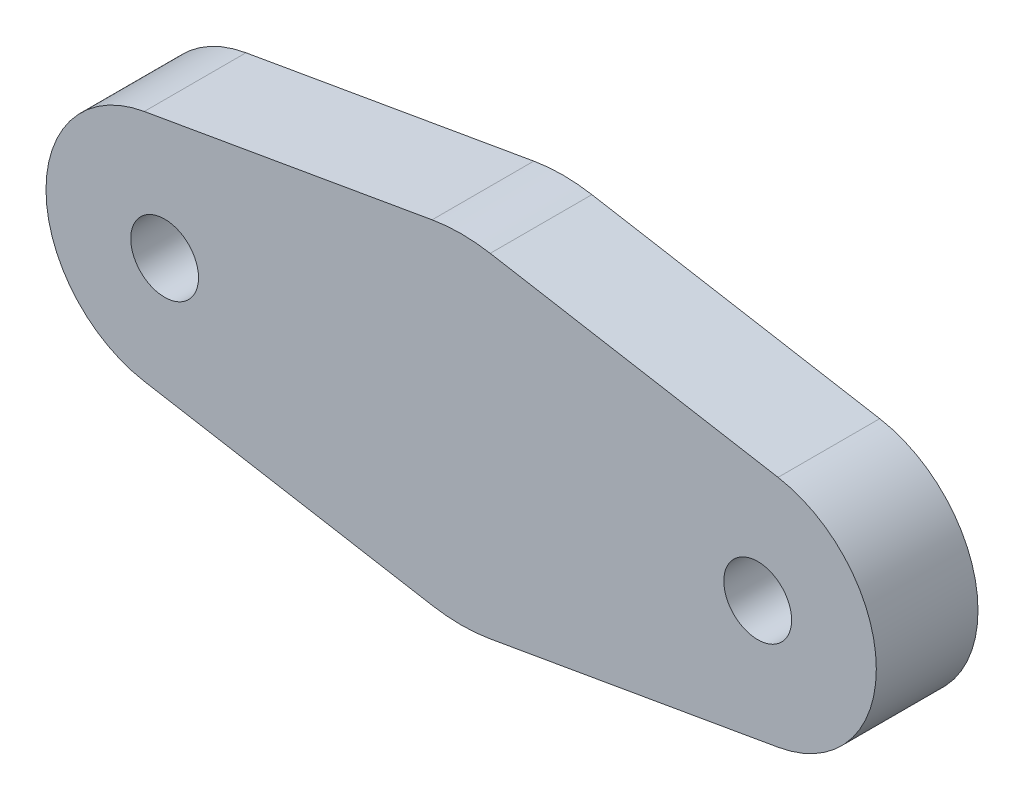
ISO-10303-21;
HEADER;
FILE_DESCRIPTION(('STEP AP214'),'2;1');
FILE_NAME('part.step','',(''),(''),'','','');
FILE_SCHEMA(('AUTOMOTIVE_DESIGN { 1 0 10303 214 1 1 1 1 }'));
ENDSEC;
DATA;
#1=APPLICATION_CONTEXT('core data for automotive mechanical design processes');
#2=APPLICATION_PROTOCOL_DEFINITION('international standard','automotive_design',2000,#1);
#3=PRODUCT_CONTEXT('',#1,'mechanical');
#4=PRODUCT('Part','Part','',(#3));
#5=PRODUCT_RELATED_PRODUCT_CATEGORY('part','',(#4));
#6=PRODUCT_DEFINITION_FORMATION('','',#4);
#7=PRODUCT_DEFINITION_CONTEXT('part definition',#1,'design');
#8=PRODUCT_DEFINITION('design','',#6,#7);
#9=PRODUCT_DEFINITION_SHAPE('','',#8);
#10=(LENGTH_UNIT() NAMED_UNIT(*) SI_UNIT(.MILLI.,.METRE.));
#11=(NAMED_UNIT(*) PLANE_ANGLE_UNIT() SI_UNIT($,.RADIAN.));
#12=(NAMED_UNIT(*) SI_UNIT($,.STERADIAN.) SOLID_ANGLE_UNIT());
#13=UNCERTAINTY_MEASURE_WITH_UNIT(LENGTH_MEASURE(1.E-05),#10,'distance_accuracy_value','');
#14=(GEOMETRIC_REPRESENTATION_CONTEXT(3) GLOBAL_UNCERTAINTY_ASSIGNED_CONTEXT((#13)) GLOBAL_UNIT_ASSIGNED_CONTEXT((#10,
#11,#12)) REPRESENTATION_CONTEXT('',''));
#15=CARTESIAN_POINT('',(0.,0.,0.));
#16=DIRECTION('',(0.,0.,1.));
#17=DIRECTION('',(1.,0.,0.));
#18=AXIS2_PLACEMENT_3D('',#15,#16,#17);
#19=CARTESIAN_POINT('',(0.,0.,6.));
#20=DIRECTION('',(0.,0.,1.));
#21=DIRECTION('',(1.,0.,0.));
#22=AXIS2_PLACEMENT_3D('',#19,#20,#21);
#23=PLANE('',#22);
#24=CARTESIAN_POINT('',(-17.5,0.,6.));
#25=DIRECTION('',(0.,0.,1.));
#26=DIRECTION('',(1.,0.,0.));
#27=AXIS2_PLACEMENT_3D('',#24,#25,#26);
#28=CIRCLE('',#27,2.);
#29=CARTESIAN_POINT('',(-15.5,0.,6.));
#30=VERTEX_POINT('',#29);
#31=EDGE_CURVE('E134',#30,#30,#28,.T.);
#32=ORIENTED_EDGE('',*,*,#31,.F.);
#33=EDGE_LOOP('',(#32));
#34=FACE_BOUND('',#33,.T.);
#35=CARTESIAN_POINT('',(0.,0.,6.));
#36=DIRECTION('',(0.,0.,1.));
#37=DIRECTION('',(1.,0.,0.));
#38=AXIS2_PLACEMENT_3D('',#35,#36,#37);
#39=CIRCLE('',#38,10.);
#40=CARTESIAN_POINT('',(1.71428571428571,9.8519655140381,6.));
#41=VERTEX_POINT('',#40);
#42=CARTESIAN_POINT('',(-1.71428571428571,9.8519655140381,6.));
#43=VERTEX_POINT('',#42);
#44=EDGE_CURVE('E145',#41,#43,#39,.T.);
#45=ORIENTED_EDGE('',*,*,#44,.T.);
#46=DIRECTION('',(-0.98519655140381,-0.171428571428572,0.));
#47=VECTOR('',#46,1.);
#48=CARTESIAN_POINT('',(-1.71428571428571,9.8519655140381,6.));
#49=LINE('',#48,#47);
#50=CARTESIAN_POINT('',(-18.7,6.89637585982667,6.));
#51=VERTEX_POINT('',#50);
#52=EDGE_CURVE('E93',#43,#51,#49,.T.);
#53=ORIENTED_EDGE('',*,*,#52,.T.);
#54=CARTESIAN_POINT('',(-17.5,0.,6.));
#55=DIRECTION('',(0.,0.,1.));
#56=DIRECTION('',(1.,0.,0.));
#57=AXIS2_PLACEMENT_3D('',#54,#55,#56);
#58=CIRCLE('',#57,7.);
#59=CARTESIAN_POINT('',(-18.7,-6.89637585982667,6.));
#60=VERTEX_POINT('',#59);
#61=EDGE_CURVE('E160',#51,#60,#58,.T.);
#62=ORIENTED_EDGE('',*,*,#61,.T.);
#63=DIRECTION('',(0.98519655140381,-0.171428571428572,0.));
#64=VECTOR('',#63,1.);
#65=CARTESIAN_POINT('',(-1.71428571428572,-9.8519655140381,6.));
#66=LINE('',#65,#64);
#67=CARTESIAN_POINT('',(-1.71428571428572,-9.8519655140381,6.));
#68=VERTEX_POINT('',#67);
#69=EDGE_CURVE('E173',#60,#68,#66,.T.);
#70=ORIENTED_EDGE('',*,*,#69,.T.);
#71=CARTESIAN_POINT('',(0.,0.,6.));
#72=DIRECTION('',(0.,0.,1.));
#73=DIRECTION('',(1.,0.,0.));
#74=AXIS2_PLACEMENT_3D('',#71,#72,#73);
#75=CIRCLE('',#74,10.);
#76=CARTESIAN_POINT('',(1.71428571428571,-9.8519655140381,6.));
#77=VERTEX_POINT('',#76);
#78=EDGE_CURVE('E112',#68,#77,#75,.T.);
#79=ORIENTED_EDGE('',*,*,#78,.T.);
#80=DIRECTION('',(0.985196551403809,0.171428571428572,0.));
#81=VECTOR('',#80,1.);
#82=CARTESIAN_POINT('',(18.7,-6.89637585982667,6.));
#83=LINE('',#82,#81);
#84=CARTESIAN_POINT('',(18.7,-6.89637585982667,6.));
#85=VERTEX_POINT('',#84);
#86=EDGE_CURVE('E106',#77,#85,#83,.T.);
#87=ORIENTED_EDGE('',*,*,#86,.T.);
#88=CARTESIAN_POINT('',(17.5,0.,6.));
#89=DIRECTION('',(0.,0.,1.));
#90=DIRECTION('',(1.,0.,0.));
#91=AXIS2_PLACEMENT_3D('',#88,#89,#90);
#92=CIRCLE('',#91,7.);
#93=CARTESIAN_POINT('',(18.7,6.89637585982668,6.));
#94=VERTEX_POINT('',#93);
#95=EDGE_CURVE('E110',#85,#94,#92,.T.);
#96=ORIENTED_EDGE('',*,*,#95,.T.);
#97=DIRECTION('',(-0.985196551403809,0.171428571428571,0.));
#98=VECTOR('',#97,1.);
#99=CARTESIAN_POINT('',(18.7,6.89637585982668,6.));
#100=LINE('',#99,#98);
#101=EDGE_CURVE('E50',#94,#41,#100,.T.);
#102=ORIENTED_EDGE('',*,*,#101,.T.);
#103=EDGE_LOOP('',(#45,#53,#62,#70,#79,#87,#96,#102));
#104=FACE_BOUND('',#103,.T.);
#105=CARTESIAN_POINT('',(17.5,0.,6.));
#106=DIRECTION('',(0.,0.,1.));
#107=DIRECTION('',(1.,0.,0.));
#108=AXIS2_PLACEMENT_3D('',#105,#106,#107);
#109=CIRCLE('',#108,2.);
#110=CARTESIAN_POINT('',(19.5,0.,6.));
#111=VERTEX_POINT('',#110);
#112=EDGE_CURVE('E182',#111,#111,#109,.T.);
#113=ORIENTED_EDGE('',*,*,#112,.F.);
#114=EDGE_LOOP('',(#113));
#115=FACE_BOUND('',#114,.T.);
#116=ADVANCED_FACE('F33',(#34,#104,#115),#23,.T.);
#117=CARTESIAN_POINT('',(0.,0.,0.));
#118=DIRECTION('',(0.,0.,1.));
#119=DIRECTION('',(1.,0.,0.));
#120=AXIS2_PLACEMENT_3D('',#117,#118,#119);
#121=PLANE('',#120);
#122=CARTESIAN_POINT('',(-17.5,0.,0.));
#123=DIRECTION('',(0.,0.,1.));
#124=DIRECTION('',(1.,0.,0.));
#125=AXIS2_PLACEMENT_3D('',#122,#123,#124);
#126=CIRCLE('',#125,2.);
#127=CARTESIAN_POINT('',(-15.5,0.,0.));
#128=VERTEX_POINT('',#127);
#129=EDGE_CURVE('E179',#128,#128,#126,.T.);
#130=ORIENTED_EDGE('',*,*,#129,.T.);
#131=EDGE_LOOP('',(#130));
#132=FACE_BOUND('',#131,.T.);
#133=CARTESIAN_POINT('',(0.,0.,0.));
#134=DIRECTION('',(0.,0.,1.));
#135=DIRECTION('',(1.,0.,0.));
#136=AXIS2_PLACEMENT_3D('',#133,#134,#135);
#137=CIRCLE('',#136,10.);
#138=CARTESIAN_POINT('',(1.71428571428571,9.8519655140381,0.));
#139=VERTEX_POINT('',#138);
#140=CARTESIAN_POINT('',(-1.71428571428571,9.8519655140381,0.));
#141=VERTEX_POINT('',#140);
#142=EDGE_CURVE('E130',#139,#141,#137,.T.);
#143=ORIENTED_EDGE('',*,*,#142,.F.);
#144=DIRECTION('',(-0.985196551403809,0.171428571428571,0.));
#145=VECTOR('',#144,1.);
#146=CARTESIAN_POINT('',(18.7,6.89637585982668,0.));
#147=LINE('',#146,#145);
#148=CARTESIAN_POINT('',(18.7,6.89637585982668,0.));
#149=VERTEX_POINT('',#148);
#150=EDGE_CURVE('E85',#149,#139,#147,.T.);
#151=ORIENTED_EDGE('',*,*,#150,.F.);
#152=CARTESIAN_POINT('',(17.5,0.,0.));
#153=DIRECTION('',(0.,0.,1.));
#154=DIRECTION('',(1.,0.,0.));
#155=AXIS2_PLACEMENT_3D('',#152,#153,#154);
#156=CIRCLE('',#155,7.);
#157=CARTESIAN_POINT('',(18.7,-6.89637585982667,0.));
#158=VERTEX_POINT('',#157);
#159=EDGE_CURVE('E79',#158,#149,#156,.T.);
#160=ORIENTED_EDGE('',*,*,#159,.F.);
#161=DIRECTION('',(0.985196551403809,0.171428571428572,0.));
#162=VECTOR('',#161,1.);
#163=CARTESIAN_POINT('',(18.7,-6.89637585982667,0.));
#164=LINE('',#163,#162);
#165=CARTESIAN_POINT('',(1.71428571428571,-9.8519655140381,0.));
#166=VERTEX_POINT('',#165);
#167=EDGE_CURVE('E120',#166,#158,#164,.T.);
#168=ORIENTED_EDGE('',*,*,#167,.F.);
#169=CARTESIAN_POINT('',(0.,0.,0.));
#170=DIRECTION('',(0.,0.,1.));
#171=DIRECTION('',(1.,0.,0.));
#172=AXIS2_PLACEMENT_3D('',#169,#170,#171);
#173=CIRCLE('',#172,10.);
#174=CARTESIAN_POINT('',(-1.71428571428572,-9.8519655140381,0.));
#175=VERTEX_POINT('',#174);
#176=EDGE_CURVE('E140',#175,#166,#173,.T.);
#177=ORIENTED_EDGE('',*,*,#176,.F.);
#178=DIRECTION('',(0.98519655140381,-0.171428571428572,0.));
#179=VECTOR('',#178,1.);
#180=CARTESIAN_POINT('',(-1.71428571428572,-9.8519655140381,0.));
#181=LINE('',#180,#179);
#182=CARTESIAN_POINT('',(-18.7,-6.89637585982667,0.));
#183=VERTEX_POINT('',#182);
#184=EDGE_CURVE('E138',#183,#175,#181,.T.);
#185=ORIENTED_EDGE('',*,*,#184,.F.);
#186=CARTESIAN_POINT('',(-17.5,0.,0.));
#187=DIRECTION('',(0.,0.,1.));
#188=DIRECTION('',(1.,0.,0.));
#189=AXIS2_PLACEMENT_3D('',#186,#187,#188);
#190=CIRCLE('',#189,7.);
#191=CARTESIAN_POINT('',(-18.7,6.89637585982667,0.));
#192=VERTEX_POINT('',#191);
#193=EDGE_CURVE('E136',#192,#183,#190,.T.);
#194=ORIENTED_EDGE('',*,*,#193,.F.);
#195=DIRECTION('',(-0.98519655140381,-0.171428571428572,0.));
#196=VECTOR('',#195,1.);
#197=CARTESIAN_POINT('',(-1.71428571428571,9.8519655140381,0.));
#198=LINE('',#197,#196);
#199=EDGE_CURVE('E133',#141,#192,#198,.T.);
#200=ORIENTED_EDGE('',*,*,#199,.F.);
#201=EDGE_LOOP('',(#143,#151,#160,#168,#177,#185,#194,#200));
#202=FACE_BOUND('',#201,.T.);
#203=CARTESIAN_POINT('',(17.5,0.,0.));
#204=DIRECTION('',(0.,0.,1.));
#205=DIRECTION('',(1.,0.,0.));
#206=AXIS2_PLACEMENT_3D('',#203,#204,#205);
#207=CIRCLE('',#206,2.);
#208=CARTESIAN_POINT('',(19.5,0.,0.));
#209=VERTEX_POINT('',#208);
#210=EDGE_CURVE('E185',#209,#209,#207,.T.);
#211=ORIENTED_EDGE('',*,*,#210,.T.);
#212=EDGE_LOOP('',(#211));
#213=FACE_BOUND('',#212,.T.);
#214=ADVANCED_FACE('F164',(#132,#202,#213),#121,.F.);
#215=CARTESIAN_POINT('',(0.,0.,6.));
#216=DIRECTION('',(0.,0.,-1.));
#217=DIRECTION('',(-1.,0.,0.));
#218=AXIS2_PLACEMENT_3D('',#215,#216,#217);
#219=CYLINDRICAL_SURFACE('',#218,10.);
#220=ORIENTED_EDGE('',*,*,#142,.T.);
#221=DIRECTION('',(0.,0.,-1.));
#222=VECTOR('',#221,1.);
#223=CARTESIAN_POINT('',(-1.71428571428571,9.8519655140381,6.));
#224=LINE('',#223,#222);
#225=EDGE_CURVE('E11',#43,#141,#224,.T.);
#226=ORIENTED_EDGE('',*,*,#225,.F.);
#227=ORIENTED_EDGE('',*,*,#44,.F.);
#228=DIRECTION('',(0.,0.,-1.));
#229=VECTOR('',#228,1.);
#230=CARTESIAN_POINT('',(1.71428571428571,9.8519655140381,6.));
#231=LINE('',#230,#229);
#232=EDGE_CURVE('E126',#41,#139,#231,.T.);
#233=ORIENTED_EDGE('',*,*,#232,.T.);
#234=EDGE_LOOP('',(#220,#226,#227,#233));
#235=FACE_BOUND('',#234,.T.);
#236=ADVANCED_FACE('F35',(#235),#219,.T.);
#237=CARTESIAN_POINT('',(-1.71428571428571,9.8519655140381,6.));
#238=DIRECTION('',(0.171428571428572,-0.985196551403809,0.));
#239=DIRECTION('',(0.98519655140381,0.171428571428572,0.));
#240=AXIS2_PLACEMENT_3D('',#237,#238,#239);
#241=PLANE('',#240);
#242=ORIENTED_EDGE('',*,*,#199,.T.);
#243=DIRECTION('',(0.,0.,-1.));
#244=VECTOR('',#243,1.);
#245=CARTESIAN_POINT('',(-18.7,6.89637585982667,6.));
#246=LINE('',#245,#244);
#247=EDGE_CURVE('E42',#51,#192,#246,.T.);
#248=ORIENTED_EDGE('',*,*,#247,.F.);
#249=ORIENTED_EDGE('',*,*,#52,.F.);
#250=ORIENTED_EDGE('',*,*,#225,.T.);
#251=EDGE_LOOP('',(#242,#248,#249,#250));
#252=FACE_BOUND('',#251,.T.);
#253=ADVANCED_FACE('F218',(#252),#241,.F.);
#254=CARTESIAN_POINT('',(-17.5,0.,6.));
#255=DIRECTION('',(0.,0.,-1.));
#256=DIRECTION('',(-1.,0.,0.));
#257=AXIS2_PLACEMENT_3D('',#254,#255,#256);
#258=CYLINDRICAL_SURFACE('',#257,7.);
#259=ORIENTED_EDGE('',*,*,#193,.T.);
#260=DIRECTION('',(0.,0.,-1.));
#261=VECTOR('',#260,1.);
#262=CARTESIAN_POINT('',(-18.7,-6.89637585982667,6.));
#263=LINE('',#262,#261);
#264=EDGE_CURVE('E152',#60,#183,#263,.T.);
#265=ORIENTED_EDGE('',*,*,#264,.F.);
#266=ORIENTED_EDGE('',*,*,#61,.F.);
#267=ORIENTED_EDGE('',*,*,#247,.T.);
#268=EDGE_LOOP('',(#259,#265,#266,#267));
#269=FACE_BOUND('',#268,.T.);
#270=ADVANCED_FACE('F158',(#269),#258,.T.);
#271=CARTESIAN_POINT('',(-1.71428571428572,-9.8519655140381,6.));
#272=DIRECTION('',(0.171428571428572,0.985196551403809,0.));
#273=DIRECTION('',(-0.98519655140381,0.171428571428572,0.));
#274=AXIS2_PLACEMENT_3D('',#271,#272,#273);
#275=PLANE('',#274);
#276=ORIENTED_EDGE('',*,*,#184,.T.);
#277=DIRECTION('',(0.,0.,-1.));
#278=VECTOR('',#277,1.);
#279=CARTESIAN_POINT('',(-1.71428571428572,-9.8519655140381,6.));
#280=LINE('',#279,#278);
#281=EDGE_CURVE('E149',#68,#175,#280,.T.);
#282=ORIENTED_EDGE('',*,*,#281,.F.);
#283=ORIENTED_EDGE('',*,*,#69,.F.);
#284=ORIENTED_EDGE('',*,*,#264,.T.);
#285=EDGE_LOOP('',(#276,#282,#283,#284));
#286=FACE_BOUND('',#285,.T.);
#287=ADVANCED_FACE('F169',(#286),#275,.F.);
#288=CARTESIAN_POINT('',(0.,0.,6.));
#289=DIRECTION('',(0.,0.,-1.));
#290=DIRECTION('',(-1.,0.,0.));
#291=AXIS2_PLACEMENT_3D('',#288,#289,#290);
#292=CYLINDRICAL_SURFACE('',#291,10.);
#293=ORIENTED_EDGE('',*,*,#176,.T.);
#294=DIRECTION('',(0.,0.,-1.));
#295=VECTOR('',#294,1.);
#296=CARTESIAN_POINT('',(1.71428571428571,-9.8519655140381,6.));
#297=LINE('',#296,#295);
#298=EDGE_CURVE('E121',#77,#166,#297,.T.);
#299=ORIENTED_EDGE('',*,*,#298,.F.);
#300=ORIENTED_EDGE('',*,*,#78,.F.);
#301=ORIENTED_EDGE('',*,*,#281,.T.);
#302=EDGE_LOOP('',(#293,#299,#300,#301));
#303=FACE_BOUND('',#302,.T.);
#304=ADVANCED_FACE('F172',(#303),#292,.T.);
#305=CARTESIAN_POINT('',(18.7,-6.89637585982667,6.));
#306=DIRECTION('',(-0.171428571428572,0.98519655140381,0.));
#307=DIRECTION('',(-0.98519655140381,-0.171428571428572,0.));
#308=AXIS2_PLACEMENT_3D('',#305,#306,#307);
#309=PLANE('',#308);
#310=ORIENTED_EDGE('',*,*,#167,.T.);
#311=DIRECTION('',(0.,0.,-1.));
#312=VECTOR('',#311,1.);
#313=CARTESIAN_POINT('',(18.7,-6.89637585982667,6.));
#314=LINE('',#313,#312);
#315=EDGE_CURVE('E117',#85,#158,#314,.T.);
#316=ORIENTED_EDGE('',*,*,#315,.F.);
#317=ORIENTED_EDGE('',*,*,#86,.F.);
#318=ORIENTED_EDGE('',*,*,#298,.T.);
#319=EDGE_LOOP('',(#310,#316,#317,#318));
#320=FACE_BOUND('',#319,.T.);
#321=ADVANCED_FACE('F118',(#320),#309,.F.);
#322=CARTESIAN_POINT('',(17.5,0.,6.));
#323=DIRECTION('',(0.,0.,-1.));
#324=DIRECTION('',(-1.,0.,0.));
#325=AXIS2_PLACEMENT_3D('',#322,#323,#324);
#326=CYLINDRICAL_SURFACE('',#325,7.);
#327=ORIENTED_EDGE('',*,*,#159,.T.);
#328=DIRECTION('',(0.,0.,-1.));
#329=VECTOR('',#328,1.);
#330=CARTESIAN_POINT('',(18.7,6.89637585982668,6.));
#331=LINE('',#330,#329);
#332=EDGE_CURVE('E122',#94,#149,#331,.T.);
#333=ORIENTED_EDGE('',*,*,#332,.F.);
#334=ORIENTED_EDGE('',*,*,#95,.F.);
#335=ORIENTED_EDGE('',*,*,#315,.T.);
#336=EDGE_LOOP('',(#327,#333,#334,#335));
#337=FACE_BOUND('',#336,.T.);
#338=ADVANCED_FACE('F124',(#337),#326,.T.);
#339=CARTESIAN_POINT('',(18.7,6.89637585982668,6.));
#340=DIRECTION('',(-0.171428571428571,-0.98519655140381,0.));
#341=DIRECTION('',(0.98519655140381,-0.171428571428571,0.));
#342=AXIS2_PLACEMENT_3D('',#339,#340,#341);
#343=PLANE('',#342);
#344=ORIENTED_EDGE('',*,*,#150,.T.);
#345=ORIENTED_EDGE('',*,*,#232,.F.);
#346=ORIENTED_EDGE('',*,*,#101,.F.);
#347=ORIENTED_EDGE('',*,*,#332,.T.);
#348=EDGE_LOOP('',(#344,#345,#346,#347));
#349=FACE_BOUND('',#348,.T.);
#350=ADVANCED_FACE('F206',(#349),#343,.F.);
#351=CARTESIAN_POINT('',(-17.5,0.,6.));
#352=DIRECTION('',(0.,0.,-1.));
#353=DIRECTION('',(-1.,0.,0.));
#354=AXIS2_PLACEMENT_3D('',#351,#352,#353);
#355=CYLINDRICAL_SURFACE('',#354,2.);
#356=ORIENTED_EDGE('',*,*,#31,.T.);
#357=EDGE_LOOP('',(#356));
#358=FACE_BOUND('',#357,.T.);
#359=ORIENTED_EDGE('',*,*,#129,.F.);
#360=EDGE_LOOP('',(#359));
#361=FACE_BOUND('',#360,.T.);
#362=ADVANCED_FACE('F203',(#358,#361),#355,.F.);
#363=CARTESIAN_POINT('',(17.5,0.,6.));
#364=DIRECTION('',(0.,0.,-1.));
#365=DIRECTION('',(-1.,0.,0.));
#366=AXIS2_PLACEMENT_3D('',#363,#364,#365);
#367=CYLINDRICAL_SURFACE('',#366,2.);
#368=ORIENTED_EDGE('',*,*,#112,.T.);
#369=EDGE_LOOP('',(#368));
#370=FACE_BOUND('',#369,.T.);
#371=ORIENTED_EDGE('',*,*,#210,.F.);
#372=EDGE_LOOP('',(#371));
#373=FACE_BOUND('',#372,.T.);
#374=ADVANCED_FACE('F191',(#370,#373),#367,.F.);
#375=CLOSED_SHELL('',(#116,#214,#236,#253,#270,#287,#304,#321,#338,#350,#362,#374));
#376=MANIFOLD_SOLID_BREP('B2',#375);
#377=ADVANCED_BREP_SHAPE_REPRESENTATION('',(#18,#376),#14);
#378=SHAPE_DEFINITION_REPRESENTATION(#9,#377);
ENDSEC;
END-ISO-10303-21;
